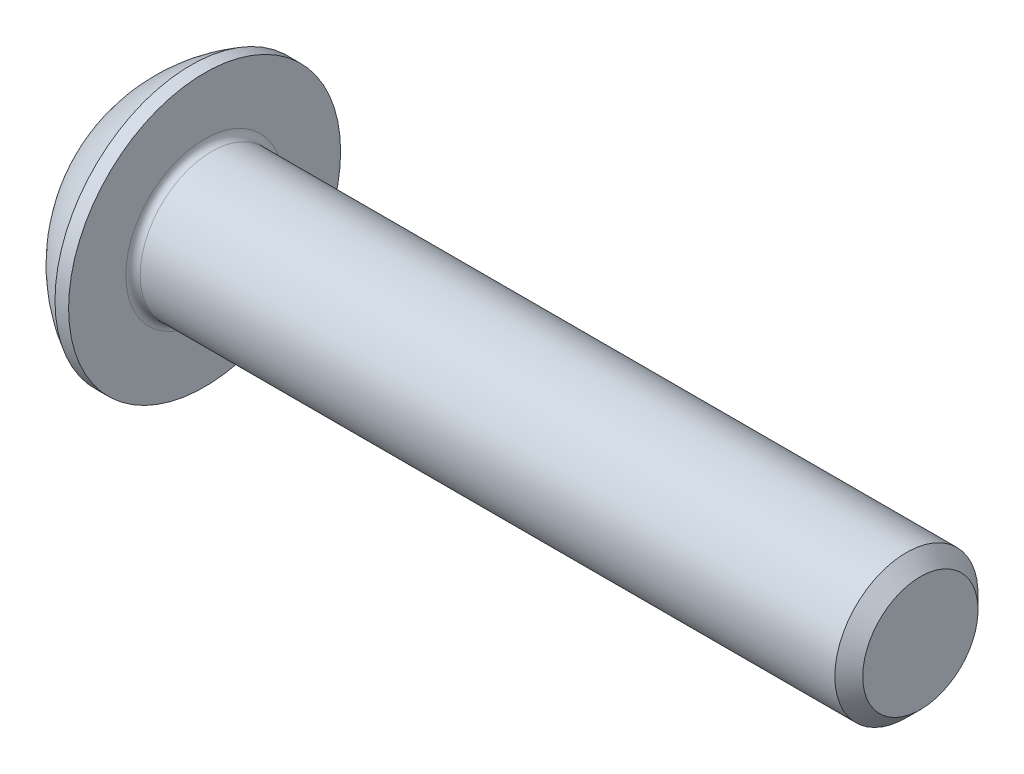
ISO-10303-21;
HEADER;
FILE_DESCRIPTION(('STEP AP214'),'2;1');
FILE_NAME('part.step','',(''),(''),'','','');
FILE_SCHEMA(('AUTOMOTIVE_DESIGN { 1 0 10303 214 1 1 1 1 }'));
ENDSEC;
DATA;
#1=APPLICATION_CONTEXT('core data for automotive mechanical design processes');
#2=APPLICATION_PROTOCOL_DEFINITION('international standard','automotive_design',2000,#1);
#3=PRODUCT_CONTEXT('',#1,'mechanical');
#4=PRODUCT('Part','Part','',(#3));
#5=PRODUCT_RELATED_PRODUCT_CATEGORY('part','',(#4));
#6=PRODUCT_DEFINITION_FORMATION('','',#4);
#7=PRODUCT_DEFINITION_CONTEXT('part definition',#1,'design');
#8=PRODUCT_DEFINITION('design','',#6,#7);
#9=PRODUCT_DEFINITION_SHAPE('','',#8);
#10=(LENGTH_UNIT() NAMED_UNIT(*) SI_UNIT(.MILLI.,.METRE.));
#11=(NAMED_UNIT(*) PLANE_ANGLE_UNIT() SI_UNIT($,.RADIAN.));
#12=(NAMED_UNIT(*) SI_UNIT($,.STERADIAN.) SOLID_ANGLE_UNIT());
#13=UNCERTAINTY_MEASURE_WITH_UNIT(LENGTH_MEASURE(1.E-05),#10,'distance_accuracy_value','');
#14=(GEOMETRIC_REPRESENTATION_CONTEXT(3) GLOBAL_UNCERTAINTY_ASSIGNED_CONTEXT((#13)) GLOBAL_UNIT_ASSIGNED_CONTEXT((#10,
#11,#12)) REPRESENTATION_CONTEXT('',''));
#15=CARTESIAN_POINT('',(0.,0.,0.));
#16=DIRECTION('',(0.,0.,1.));
#17=DIRECTION('',(1.,0.,0.));
#18=AXIS2_PLACEMENT_3D('',#15,#16,#17);
#19=CARTESIAN_POINT('',(0.,0.,0.));
#20=DIRECTION('',(-1.,0.,0.));
#21=DIRECTION('',(0.,0.,1.));
#22=AXIS2_PLACEMENT_3D('',#19,#20,#21);
#23=PLANE('',#22);
#24=CARTESIAN_POINT('',(0.,0.,0.));
#25=DIRECTION('',(-1.,0.,0.));
#26=DIRECTION('',(0.,0.,1.));
#27=AXIS2_PLACEMENT_3D('',#24,#25,#26);
#28=CIRCLE('',#27,1.9);
#29=CARTESIAN_POINT('',(0.,0.,1.9));
#30=VERTEX_POINT('',#29);
#31=EDGE_CURVE('E154',#30,#30,#28,.T.);
#32=ORIENTED_EDGE('',*,*,#31,.T.);
#33=EDGE_LOOP('',(#32));
#34=FACE_BOUND('',#33,.T.);
#35=DIRECTION('',(0.,-1.,0.));
#36=VECTOR('',#35,1.);
#37=CARTESIAN_POINT('',(0.,-0.721687836487031,1.25));
#38=LINE('',#37,#36);
#39=CARTESIAN_POINT('',(0.,0.721687836487033,1.25));
#40=VERTEX_POINT('',#39);
#41=CARTESIAN_POINT('',(0.,-0.721687836487031,1.25));
#42=VERTEX_POINT('',#41);
#43=EDGE_CURVE('E49',#40,#42,#38,.T.);
#44=ORIENTED_EDGE('',*,*,#43,.T.);
#45=DIRECTION('',(0.,-0.5,-0.866025403784439));
#46=VECTOR('',#45,1.);
#47=CARTESIAN_POINT('',(0.,-1.44337567297406,0.));
#48=LINE('',#47,#46);
#49=CARTESIAN_POINT('',(0.,-1.44337567297406,0.));
#50=VERTEX_POINT('',#49);
#51=EDGE_CURVE('E274',#42,#50,#48,.T.);
#52=ORIENTED_EDGE('',*,*,#51,.T.);
#53=DIRECTION('',(0.,0.5,-0.866025403784439));
#54=VECTOR('',#53,1.);
#55=CARTESIAN_POINT('',(0.,-0.721687836487031,-1.25));
#56=LINE('',#55,#54);
#57=CARTESIAN_POINT('',(0.,-0.721687836487031,-1.25));
#58=VERTEX_POINT('',#57);
#59=EDGE_CURVE('E129',#50,#58,#56,.T.);
#60=ORIENTED_EDGE('',*,*,#59,.T.);
#61=DIRECTION('',(0.,1.,0.));
#62=VECTOR('',#61,1.);
#63=CARTESIAN_POINT('',(0.,0.721687836487033,-1.25));
#64=LINE('',#63,#62);
#65=CARTESIAN_POINT('',(0.,0.721687836487033,-1.25));
#66=VERTEX_POINT('',#65);
#67=EDGE_CURVE('E277',#58,#66,#64,.T.);
#68=ORIENTED_EDGE('',*,*,#67,.T.);
#69=DIRECTION('',(0.,0.5,0.866025403784439));
#70=VECTOR('',#69,1.);
#71=CARTESIAN_POINT('',(0.,1.44337567297407,0.));
#72=LINE('',#71,#70);
#73=CARTESIAN_POINT('',(0.,1.44337567297407,0.));
#74=VERTEX_POINT('',#73);
#75=EDGE_CURVE('E279',#66,#74,#72,.T.);
#76=ORIENTED_EDGE('',*,*,#75,.T.);
#77=DIRECTION('',(0.,-0.5,0.866025403784439));
#78=VECTOR('',#77,1.);
#79=CARTESIAN_POINT('',(0.,0.721687836487033,1.25));
#80=LINE('',#79,#78);
#81=EDGE_CURVE('E281',#74,#40,#80,.T.);
#82=ORIENTED_EDGE('',*,*,#81,.T.);
#83=EDGE_LOOP('',(#44,#52,#60,#68,#76,#82));
#84=FACE_BOUND('',#83,.T.);
#85=ADVANCED_FACE('F34',(#34,#84),#23,.T.);
#86=CARTESIAN_POINT('',(3.88527472527473,0.,0.));
#87=DIRECTION('',(-1.,0.,0.));
#88=DIRECTION('',(0.,1.,0.));
#89=AXIS2_PLACEMENT_3D('',#86,#87,#88);
#90=SPHERICAL_SURFACE('',#89,4.3249693283142);
#91=CARTESIAN_POINT('',(1.82,0.,0.));
#92=DIRECTION('',(-1.,0.,0.));
#93=DIRECTION('',(0.,0.,1.));
#94=AXIS2_PLACEMENT_3D('',#91,#92,#93);
#95=CIRCLE('',#94,3.8);
#96=CARTESIAN_POINT('',(1.82,0.,3.8));
#97=VERTEX_POINT('',#96);
#98=EDGE_CURVE('E151',#97,#97,#95,.T.);
#99=ORIENTED_EDGE('',*,*,#98,.T.);
#100=EDGE_LOOP('',(#99));
#101=FACE_BOUND('',#100,.T.);
#102=ORIENTED_EDGE('',*,*,#31,.F.);
#103=EDGE_LOOP('',(#102));
#104=FACE_BOUND('',#103,.T.);
#105=ADVANCED_FACE('F175',(#101,#104),#90,.T.);
#106=CARTESIAN_POINT('',(0.,0.,0.));
#107=DIRECTION('',(-1.,0.,0.));
#108=DIRECTION('',(0.,0.,1.));
#109=AXIS2_PLACEMENT_3D('',#106,#107,#108);
#110=CYLINDRICAL_SURFACE('',#109,3.8);
#111=ORIENTED_EDGE('',*,*,#98,.F.);
#112=EDGE_LOOP('',(#111));
#113=FACE_BOUND('',#112,.T.);
#114=CARTESIAN_POINT('',(2.2,0.,0.));
#115=DIRECTION('',(-1.,0.,0.));
#116=DIRECTION('',(0.,0.,1.));
#117=AXIS2_PLACEMENT_3D('',#114,#115,#116);
#118=CIRCLE('',#117,3.8);
#119=CARTESIAN_POINT('',(2.2,0.,3.8));
#120=VERTEX_POINT('',#119);
#121=EDGE_CURVE('E148',#120,#120,#118,.T.);
#122=ORIENTED_EDGE('',*,*,#121,.T.);
#123=EDGE_LOOP('',(#122));
#124=FACE_BOUND('',#123,.T.);
#125=ADVANCED_FACE('F180',(#113,#124),#110,.T.);
#126=CARTESIAN_POINT('',(2.2,2.,0.));
#127=DIRECTION('',(-1.,0.,0.));
#128=DIRECTION('',(0.,0.,1.));
#129=AXIS2_PLACEMENT_3D('',#126,#127,#128);
#130=PLANE('',#129);
#131=CARTESIAN_POINT('',(2.2,0.,0.));
#132=DIRECTION('',(-1.,0.,0.));
#133=DIRECTION('',(0.,0.,1.));
#134=AXIS2_PLACEMENT_3D('',#131,#132,#133);
#135=CIRCLE('',#134,2.2);
#136=CARTESIAN_POINT('',(2.2,0.,2.2));
#137=VERTEX_POINT('',#136);
#138=EDGE_CURVE('E42',#137,#137,#135,.T.);
#139=ORIENTED_EDGE('',*,*,#138,.T.);
#140=EDGE_LOOP('',(#139));
#141=FACE_BOUND('',#140,.T.);
#142=ORIENTED_EDGE('',*,*,#121,.F.);
#143=EDGE_LOOP('',(#142));
#144=FACE_BOUND('',#143,.T.);
#145=ADVANCED_FACE('F159',(#141,#144),#130,.F.);
#146=CARTESIAN_POINT('',(0.,0.,0.));
#147=DIRECTION('',(-1.,0.,0.));
#148=DIRECTION('',(0.,0.,1.));
#149=AXIS2_PLACEMENT_3D('',#146,#147,#148);
#150=CYLINDRICAL_SURFACE('',#149,2.);
#151=CARTESIAN_POINT('',(2.4,0.,0.));
#152=DIRECTION('',(-1.,0.,0.));
#153=DIRECTION('',(0.,0.,1.));
#154=AXIS2_PLACEMENT_3D('',#151,#152,#153);
#155=CIRCLE('',#154,2.);
#156=CARTESIAN_POINT('',(2.4,0.,2.));
#157=VERTEX_POINT('',#156);
#158=EDGE_CURVE('E11',#157,#157,#155,.F.);
#159=ORIENTED_EDGE('',*,*,#158,.T.);
#160=EDGE_LOOP('',(#159));
#161=FACE_BOUND('',#160,.T.);
#162=CARTESIAN_POINT('',(21.81,0.,0.));
#163=DIRECTION('',(-1.,0.,0.));
#164=DIRECTION('',(0.,0.,1.));
#165=AXIS2_PLACEMENT_3D('',#162,#163,#164);
#166=CIRCLE('',#165,2.);
#167=CARTESIAN_POINT('',(21.81,0.,2.));
#168=VERTEX_POINT('',#167);
#169=EDGE_CURVE('E145',#168,#168,#166,.T.);
#170=ORIENTED_EDGE('',*,*,#169,.T.);
#171=EDGE_LOOP('',(#170));
#172=FACE_BOUND('',#171,.T.);
#173=ADVANCED_FACE('F189',(#161,#172),#150,.T.);
#174=CARTESIAN_POINT('',(22.2,0.,0.));
#175=DIRECTION('',(-1.,0.,0.));
#176=DIRECTION('',(0.,0.,1.));
#177=AXIS2_PLACEMENT_3D('',#174,#175,#176);
#178=CONICAL_SURFACE('',#177,1.61,0.785398163397444);
#179=ORIENTED_EDGE('',*,*,#169,.F.);
#180=EDGE_LOOP('',(#179));
#181=FACE_BOUND('',#180,.T.);
#182=CARTESIAN_POINT('',(22.2,0.,0.));
#183=DIRECTION('',(-1.,0.,0.));
#184=DIRECTION('',(0.,0.,1.));
#185=AXIS2_PLACEMENT_3D('',#182,#183,#184);
#186=CIRCLE('',#185,1.61);
#187=CARTESIAN_POINT('',(22.2,0.,1.61));
#188=VERTEX_POINT('',#187);
#189=EDGE_CURVE('E141',#188,#188,#186,.T.);
#190=ORIENTED_EDGE('',*,*,#189,.T.);
#191=EDGE_LOOP('',(#190));
#192=FACE_BOUND('',#191,.T.);
#193=ADVANCED_FACE('F170',(#181,#192),#178,.T.);
#194=CARTESIAN_POINT('',(22.2,0.,0.));
#195=DIRECTION('',(-1.,0.,0.));
#196=DIRECTION('',(0.,0.,1.));
#197=AXIS2_PLACEMENT_3D('',#194,#195,#196);
#198=PLANE('',#197);
#199=ORIENTED_EDGE('',*,*,#189,.F.);
#200=EDGE_LOOP('',(#199));
#201=FACE_BOUND('',#200,.T.);
#202=ADVANCED_FACE('F163',(#201),#198,.F.);
#203=CARTESIAN_POINT('',(2.4,0.,0.));
#204=DIRECTION('',(-1.,0.,0.));
#205=DIRECTION('',(0.,0.,1.));
#206=AXIS2_PLACEMENT_3D('',#203,#204,#205);
#207=TOROIDAL_SURFACE('',#206,2.2,0.2);
#208=ORIENTED_EDGE('',*,*,#158,.F.);
#209=EDGE_LOOP('',(#208));
#210=FACE_BOUND('',#209,.T.);
#211=ORIENTED_EDGE('',*,*,#138,.F.);
#212=EDGE_LOOP('',(#211));
#213=FACE_BOUND('',#212,.T.);
#214=ADVANCED_FACE('F36',(#210,#213),#207,.F.);
#215=CARTESIAN_POINT('',(1.3,-1.44337567297406,0.));
#216=DIRECTION('',(0.,0.866025403784439,-0.5));
#217=DIRECTION('',(0.,0.5,0.866025403784439));
#218=AXIS2_PLACEMENT_3D('',#215,#216,#217);
#219=PLANE('',#218);
#220=DIRECTION('',(0.,-0.5,-0.866025403784439));
#221=VECTOR('',#220,1.);
#222=CARTESIAN_POINT('',(1.3,-1.44337567297406,0.));
#223=LINE('',#222,#221);
#224=CARTESIAN_POINT('',(1.3,-0.721687836487031,1.25));
#225=VERTEX_POINT('',#224);
#226=CARTESIAN_POINT('',(1.3,-1.08253175473055,0.625));
#227=VERTEX_POINT('',#226);
#228=EDGE_CURVE('E115',#225,#227,#223,.T.);
#229=ORIENTED_EDGE('',*,*,#228,.T.);
#230=CARTESIAN_POINT('',(1.3,-1.44337567297406,0.));
#231=VERTEX_POINT('',#230);
#232=EDGE_CURVE('E110',#227,#231,#223,.T.);
#233=ORIENTED_EDGE('',*,*,#232,.T.);
#234=DIRECTION('',(-1.,0.,0.));
#235=VECTOR('',#234,1.);
#236=CARTESIAN_POINT('',(1.3,-1.44337567297406,0.));
#237=LINE('',#236,#235);
#238=EDGE_CURVE('E112',#231,#50,#237,.T.);
#239=ORIENTED_EDGE('',*,*,#238,.T.);
#240=ORIENTED_EDGE('',*,*,#51,.F.);
#241=DIRECTION('',(-1.,0.,0.));
#242=VECTOR('',#241,1.);
#243=CARTESIAN_POINT('',(1.3,-0.721687836487031,1.25));
#244=LINE('',#243,#242);
#245=EDGE_CURVE('E270',#225,#42,#244,.T.);
#246=ORIENTED_EDGE('',*,*,#245,.F.);
#247=EDGE_LOOP('',(#229,#233,#239,#240,#246));
#248=FACE_BOUND('',#247,.T.);
#249=ADVANCED_FACE('F111',(#248),#219,.T.);
#250=CARTESIAN_POINT('',(1.3,-0.721687836487031,-1.25));
#251=DIRECTION('',(0.,0.866025403784439,0.5));
#252=DIRECTION('',(0.,-0.5,0.866025403784439));
#253=AXIS2_PLACEMENT_3D('',#250,#251,#252);
#254=PLANE('',#253);
#255=DIRECTION('',(0.,0.5,-0.866025403784439));
#256=VECTOR('',#255,1.);
#257=CARTESIAN_POINT('',(1.3,-0.721687836487031,-1.25));
#258=LINE('',#257,#256);
#259=CARTESIAN_POINT('',(1.3,-1.08253175473055,-0.625));
#260=VERTEX_POINT('',#259);
#261=EDGE_CURVE('E57',#231,#260,#258,.T.);
#262=ORIENTED_EDGE('',*,*,#261,.T.);
#263=CARTESIAN_POINT('',(1.3,-0.721687836487031,-1.25));
#264=VERTEX_POINT('',#263);
#265=EDGE_CURVE('E124',#260,#264,#258,.T.);
#266=ORIENTED_EDGE('',*,*,#265,.T.);
#267=DIRECTION('',(-1.,0.,0.));
#268=VECTOR('',#267,1.);
#269=CARTESIAN_POINT('',(1.3,-0.721687836487031,-1.25));
#270=LINE('',#269,#268);
#271=EDGE_CURVE('E131',#264,#58,#270,.T.);
#272=ORIENTED_EDGE('',*,*,#271,.T.);
#273=ORIENTED_EDGE('',*,*,#59,.F.);
#274=ORIENTED_EDGE('',*,*,#238,.F.);
#275=EDGE_LOOP('',(#262,#266,#272,#273,#274));
#276=FACE_BOUND('',#275,.T.);
#277=ADVANCED_FACE('F127',(#276),#254,.T.);
#278=CARTESIAN_POINT('',(1.3,0.721687836487033,-1.25));
#279=DIRECTION('',(0.,0.,1.));
#280=DIRECTION('',(1.,0.,0.));
#281=AXIS2_PLACEMENT_3D('',#278,#279,#280);
#282=PLANE('',#281);
#283=DIRECTION('',(0.,1.,0.));
#284=VECTOR('',#283,1.);
#285=CARTESIAN_POINT('',(1.3,0.721687836487033,-1.25));
#286=LINE('',#285,#284);
#287=CARTESIAN_POINT('',(1.3,0.,-1.25));
#288=VERTEX_POINT('',#287);
#289=EDGE_CURVE('E251',#264,#288,#286,.T.);
#290=ORIENTED_EDGE('',*,*,#289,.T.);
#291=CARTESIAN_POINT('',(1.3,0.721687836487033,-1.25));
#292=VERTEX_POINT('',#291);
#293=EDGE_CURVE('E123',#288,#292,#286,.T.);
#294=ORIENTED_EDGE('',*,*,#293,.T.);
#295=DIRECTION('',(-1.,0.,0.));
#296=VECTOR('',#295,1.);
#297=CARTESIAN_POINT('',(1.3,0.721687836487033,-1.25));
#298=LINE('',#297,#296);
#299=EDGE_CURVE('E136',#292,#66,#298,.T.);
#300=ORIENTED_EDGE('',*,*,#299,.T.);
#301=ORIENTED_EDGE('',*,*,#67,.F.);
#302=ORIENTED_EDGE('',*,*,#271,.F.);
#303=EDGE_LOOP('',(#290,#294,#300,#301,#302));
#304=FACE_BOUND('',#303,.T.);
#305=ADVANCED_FACE('F203',(#304),#282,.T.);
#306=CARTESIAN_POINT('',(1.3,1.44337567297407,0.));
#307=DIRECTION('',(0.,-0.866025403784439,0.5));
#308=DIRECTION('',(0.,-0.5,-0.866025403784439));
#309=AXIS2_PLACEMENT_3D('',#306,#307,#308);
#310=PLANE('',#309);
#311=DIRECTION('',(0.,0.5,0.866025403784439));
#312=VECTOR('',#311,1.);
#313=CARTESIAN_POINT('',(1.3,1.44337567297407,0.));
#314=LINE('',#313,#312);
#315=CARTESIAN_POINT('',(1.3,1.08253175473055,-0.625));
#316=VERTEX_POINT('',#315);
#317=EDGE_CURVE('E240',#292,#316,#314,.T.);
#318=ORIENTED_EDGE('',*,*,#317,.T.);
#319=CARTESIAN_POINT('',(1.3,1.44337567297407,0.));
#320=VERTEX_POINT('',#319);
#321=EDGE_CURVE('E245',#316,#320,#314,.T.);
#322=ORIENTED_EDGE('',*,*,#321,.T.);
#323=DIRECTION('',(-1.,0.,0.));
#324=VECTOR('',#323,1.);
#325=CARTESIAN_POINT('',(1.3,1.44337567297407,0.));
#326=LINE('',#325,#324);
#327=EDGE_CURVE('E285',#320,#74,#326,.T.);
#328=ORIENTED_EDGE('',*,*,#327,.T.);
#329=ORIENTED_EDGE('',*,*,#75,.F.);
#330=ORIENTED_EDGE('',*,*,#299,.F.);
#331=EDGE_LOOP('',(#318,#322,#328,#329,#330));
#332=FACE_BOUND('',#331,.T.);
#333=ADVANCED_FACE('F206',(#332),#310,.T.);
#334=CARTESIAN_POINT('',(1.3,0.721687836487033,1.25));
#335=DIRECTION('',(0.,-0.866025403784439,-0.5));
#336=DIRECTION('',(0.,0.5,-0.866025403784439));
#337=AXIS2_PLACEMENT_3D('',#334,#335,#336);
#338=PLANE('',#337);
#339=DIRECTION('',(0.,-0.5,0.866025403784439));
#340=VECTOR('',#339,1.);
#341=CARTESIAN_POINT('',(1.3,0.721687836487033,1.25));
#342=LINE('',#341,#340);
#343=CARTESIAN_POINT('',(1.3,1.08253175473055,0.625));
#344=VERTEX_POINT('',#343);
#345=EDGE_CURVE('E248',#320,#344,#342,.T.);
#346=ORIENTED_EDGE('',*,*,#345,.T.);
#347=CARTESIAN_POINT('',(1.3,0.721687836487033,1.25));
#348=VERTEX_POINT('',#347);
#349=EDGE_CURVE('E256',#344,#348,#342,.T.);
#350=ORIENTED_EDGE('',*,*,#349,.T.);
#351=DIRECTION('',(-1.,0.,0.));
#352=VECTOR('',#351,1.);
#353=CARTESIAN_POINT('',(1.3,0.721687836487033,1.25));
#354=LINE('',#353,#352);
#355=EDGE_CURVE('E269',#348,#40,#354,.T.);
#356=ORIENTED_EDGE('',*,*,#355,.T.);
#357=ORIENTED_EDGE('',*,*,#81,.F.);
#358=ORIENTED_EDGE('',*,*,#327,.F.);
#359=EDGE_LOOP('',(#346,#350,#356,#357,#358));
#360=FACE_BOUND('',#359,.T.);
#361=ADVANCED_FACE('F210',(#360),#338,.T.);
#362=CARTESIAN_POINT('',(1.3,-0.721687836487031,1.25));
#363=DIRECTION('',(0.,0.,-1.));
#364=DIRECTION('',(-1.,0.,0.));
#365=AXIS2_PLACEMENT_3D('',#362,#363,#364);
#366=PLANE('',#365);
#367=DIRECTION('',(0.,-1.,0.));
#368=VECTOR('',#367,1.);
#369=CARTESIAN_POINT('',(1.3,-0.721687836487031,1.25));
#370=LINE('',#369,#368);
#371=CARTESIAN_POINT('',(1.3,0.,1.25));
#372=VERTEX_POINT('',#371);
#373=EDGE_CURVE('E262',#348,#372,#370,.T.);
#374=ORIENTED_EDGE('',*,*,#373,.T.);
#375=EDGE_CURVE('E264',#372,#225,#370,.T.);
#376=ORIENTED_EDGE('',*,*,#375,.T.);
#377=ORIENTED_EDGE('',*,*,#245,.T.);
#378=ORIENTED_EDGE('',*,*,#43,.F.);
#379=ORIENTED_EDGE('',*,*,#355,.F.);
#380=EDGE_LOOP('',(#374,#376,#377,#378,#379));
#381=FACE_BOUND('',#380,.T.);
#382=ADVANCED_FACE('F214',(#381),#366,.T.);
#383=CARTESIAN_POINT('',(1.3,-1.44337567297406,0.));
#384=DIRECTION('',(1.,0.,0.));
#385=DIRECTION('',(0.,0.,-1.));
#386=AXIS2_PLACEMENT_3D('',#383,#384,#385);
#387=PLANE('',#386);
#388=CARTESIAN_POINT('',(1.3,0.,0.));
#389=DIRECTION('',(-1.,0.,0.));
#390=DIRECTION('',(0.,0.,1.));
#391=AXIS2_PLACEMENT_3D('',#388,#389,#390);
#392=CIRCLE('',#391,1.25);
#393=EDGE_CURVE('E237',#316,#288,#392,.T.);
#394=ORIENTED_EDGE('',*,*,#393,.F.);
#395=ORIENTED_EDGE('',*,*,#317,.F.);
#396=ORIENTED_EDGE('',*,*,#293,.F.);
#397=EDGE_LOOP('',(#394,#395,#396));
#398=FACE_BOUND('',#397,.T.);
#399=ADVANCED_FACE('F218',(#398),#387,.F.);
#400=EDGE_CURVE('E142',#344,#316,#392,.T.);
#401=ORIENTED_EDGE('',*,*,#400,.F.);
#402=ORIENTED_EDGE('',*,*,#345,.F.);
#403=ORIENTED_EDGE('',*,*,#321,.F.);
#404=EDGE_LOOP('',(#401,#402,#403));
#405=FACE_BOUND('',#404,.T.);
#406=ADVANCED_FACE('F227',(#405),#387,.F.);
#407=EDGE_CURVE('E135',#372,#344,#392,.T.);
#408=ORIENTED_EDGE('',*,*,#407,.F.);
#409=ORIENTED_EDGE('',*,*,#373,.F.);
#410=ORIENTED_EDGE('',*,*,#349,.F.);
#411=EDGE_LOOP('',(#408,#409,#410));
#412=FACE_BOUND('',#411,.T.);
#413=ADVANCED_FACE('F232',(#412),#387,.F.);
#414=EDGE_CURVE('E130',#227,#372,#392,.T.);
#415=ORIENTED_EDGE('',*,*,#414,.F.);
#416=ORIENTED_EDGE('',*,*,#228,.F.);
#417=ORIENTED_EDGE('',*,*,#375,.F.);
#418=EDGE_LOOP('',(#415,#416,#417));
#419=FACE_BOUND('',#418,.T.);
#420=ADVANCED_FACE('F225',(#419),#387,.F.);
#421=EDGE_CURVE('E121',#260,#227,#392,.T.);
#422=ORIENTED_EDGE('',*,*,#421,.F.);
#423=ORIENTED_EDGE('',*,*,#261,.F.);
#424=ORIENTED_EDGE('',*,*,#232,.F.);
#425=EDGE_LOOP('',(#422,#423,#424));
#426=FACE_BOUND('',#425,.T.);
#427=ADVANCED_FACE('F120',(#426),#387,.F.);
#428=EDGE_CURVE('E243',#288,#260,#392,.T.);
#429=ORIENTED_EDGE('',*,*,#428,.F.);
#430=ORIENTED_EDGE('',*,*,#289,.F.);
#431=ORIENTED_EDGE('',*,*,#265,.F.);
#432=EDGE_LOOP('',(#429,#430,#431));
#433=FACE_BOUND('',#432,.T.);
#434=ADVANCED_FACE('F198',(#433),#387,.F.);
#435=CARTESIAN_POINT('',(2.02168783648704,0.,0.));
#436=DIRECTION('',(-1.,0.,0.));
#437=DIRECTION('',(0.,0.,1.));
#438=AXIS2_PLACEMENT_3D('',#435,#436,#437);
#439=CONICAL_SURFACE('',#438,0.,1.04719755119659);
#440=ORIENTED_EDGE('',*,*,#407,.T.);
#441=ORIENTED_EDGE('',*,*,#400,.T.);
#442=ORIENTED_EDGE('',*,*,#393,.T.);
#443=ORIENTED_EDGE('',*,*,#428,.T.);
#444=ORIENTED_EDGE('',*,*,#421,.T.);
#445=ORIENTED_EDGE('',*,*,#414,.T.);
#446=EDGE_LOOP('',(#440,#441,#442,#443,#444,#445));
#447=FACE_BOUND('',#446,.T.);
#448=CARTESIAN_POINT('',(2.02168783648704,0.,0.));
#449=VERTEX_POINT('',#448);
#450=VERTEX_LOOP('',#449);
#451=FACE_BOUND('',#450,.T.);
#452=ADVANCED_FACE('F196',(#447,#451),#439,.F.);
#453=CLOSED_SHELL('',(#85,#105,#125,#145,#173,#193,#202,#214,#249,#277,#305,#333,#361,#382,#399,
#406,#413,#420,#427,#434,#452));
#454=MANIFOLD_SOLID_BREP('B2',#453);
#455=ADVANCED_BREP_SHAPE_REPRESENTATION('',(#18,#454),#14);
#456=SHAPE_DEFINITION_REPRESENTATION(#9,#455);
ENDSEC;
END-ISO-10303-21;
